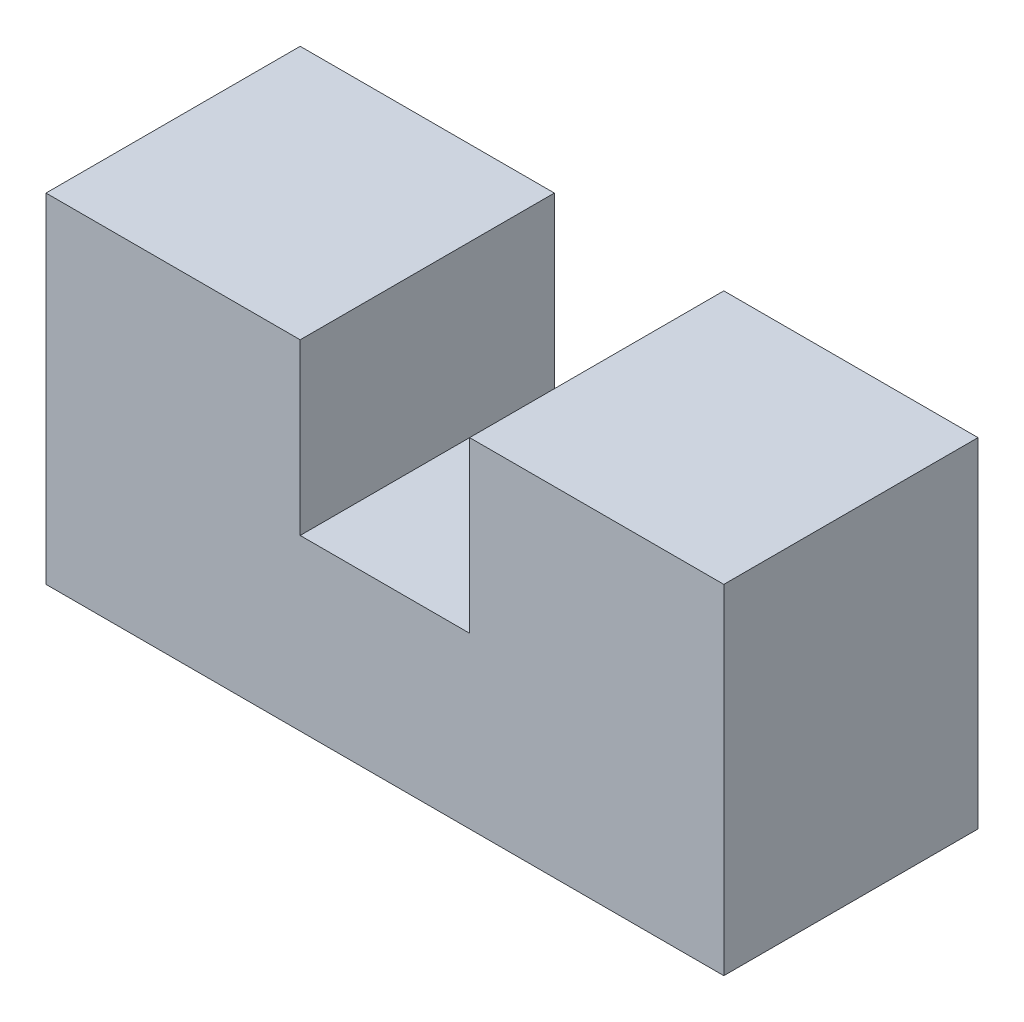
ISO-10303-21;
HEADER;
FILE_DESCRIPTION(('STEP AP214'),'2;1');
FILE_NAME('part.step','',(''),(''),'','','');
FILE_SCHEMA(('AUTOMOTIVE_DESIGN { 1 0 10303 214 1 1 1 1 }'));
ENDSEC;
DATA;
#1=APPLICATION_CONTEXT('core data for automotive mechanical design processes');
#2=APPLICATION_PROTOCOL_DEFINITION('international standard','automotive_design',2000,#1);
#3=PRODUCT_CONTEXT('',#1,'mechanical');
#4=PRODUCT('Part','Part','',(#3));
#5=PRODUCT_RELATED_PRODUCT_CATEGORY('part','',(#4));
#6=PRODUCT_DEFINITION_FORMATION('','',#4);
#7=PRODUCT_DEFINITION_CONTEXT('part definition',#1,'design');
#8=PRODUCT_DEFINITION('design','',#6,#7);
#9=PRODUCT_DEFINITION_SHAPE('','',#8);
#10=(LENGTH_UNIT() NAMED_UNIT(*) SI_UNIT(.MILLI.,.METRE.));
#11=(NAMED_UNIT(*) PLANE_ANGLE_UNIT() SI_UNIT($,.RADIAN.));
#12=(NAMED_UNIT(*) SI_UNIT($,.STERADIAN.) SOLID_ANGLE_UNIT());
#13=UNCERTAINTY_MEASURE_WITH_UNIT(LENGTH_MEASURE(1.E-05),#10,'distance_accuracy_value','');
#14=(GEOMETRIC_REPRESENTATION_CONTEXT(3) GLOBAL_UNCERTAINTY_ASSIGNED_CONTEXT((#13)) GLOBAL_UNIT_ASSIGNED_CONTEXT((#10,
#11,#12)) REPRESENTATION_CONTEXT('',''));
#15=CARTESIAN_POINT('',(0.,0.,0.));
#16=DIRECTION('',(0.,0.,1.));
#17=DIRECTION('',(1.,0.,0.));
#18=AXIS2_PLACEMENT_3D('',#15,#16,#17);
#19=CARTESIAN_POINT('',(30.,0.,15.));
#20=DIRECTION('',(0.,-1.,0.));
#21=DIRECTION('',(1.,0.,0.));
#22=AXIS2_PLACEMENT_3D('',#19,#20,#21);
#23=PLANE('',#22);
#24=DIRECTION('',(-1.,0.,0.));
#25=VECTOR('',#24,1.);
#26=CARTESIAN_POINT('',(30.,0.,-15.));
#27=LINE('',#26,#25);
#28=CARTESIAN_POINT('',(30.,0.,-15.));
#29=VERTEX_POINT('',#28);
#30=CARTESIAN_POINT('',(0.,0.,-15.));
#31=VERTEX_POINT('',#30);
#32=EDGE_CURVE('E140',#29,#31,#27,.T.);
#33=ORIENTED_EDGE('',*,*,#32,.T.);
#34=DIRECTION('',(0.,0.,-1.));
#35=VECTOR('',#34,1.);
#36=CARTESIAN_POINT('',(0.,0.,15.));
#37=LINE('',#36,#35);
#38=CARTESIAN_POINT('',(0.,0.,15.));
#39=VERTEX_POINT('',#38);
#40=EDGE_CURVE('E11',#39,#31,#37,.T.);
#41=ORIENTED_EDGE('',*,*,#40,.F.);
#42=DIRECTION('',(-1.,0.,0.));
#43=VECTOR('',#42,1.);
#44=CARTESIAN_POINT('',(30.,0.,15.));
#45=LINE('',#44,#43);
#46=CARTESIAN_POINT('',(30.,0.,15.));
#47=VERTEX_POINT('',#46);
#48=EDGE_CURVE('E162',#47,#39,#45,.T.);
#49=ORIENTED_EDGE('',*,*,#48,.F.);
#50=DIRECTION('',(0.,0.,-1.));
#51=VECTOR('',#50,1.);
#52=CARTESIAN_POINT('',(30.,0.,15.));
#53=LINE('',#52,#51);
#54=EDGE_CURVE('E136',#47,#29,#53,.T.);
#55=ORIENTED_EDGE('',*,*,#54,.T.);
#56=EDGE_LOOP('',(#33,#41,#49,#55));
#57=FACE_BOUND('',#56,.T.);
#58=ADVANCED_FACE('F39',(#57),#23,.F.);
#59=CARTESIAN_POINT('',(0.,0.,15.));
#60=DIRECTION('',(1.,0.,0.));
#61=DIRECTION('',(0.,0.,-1.));
#62=AXIS2_PLACEMENT_3D('',#59,#60,#61);
#63=PLANE('',#62);
#64=DIRECTION('',(0.,-1.,0.));
#65=VECTOR('',#64,1.);
#66=CARTESIAN_POINT('',(0.,0.,-15.));
#67=LINE('',#66,#65);
#68=CARTESIAN_POINT('',(0.,-40.,-15.));
#69=VERTEX_POINT('',#68);
#70=EDGE_CURVE('E144',#31,#69,#67,.T.);
#71=ORIENTED_EDGE('',*,*,#70,.T.);
#72=DIRECTION('',(0.,0.,-1.));
#73=VECTOR('',#72,1.);
#74=CARTESIAN_POINT('',(0.,-40.,15.));
#75=LINE('',#74,#73);
#76=CARTESIAN_POINT('',(0.,-40.,15.));
#77=VERTEX_POINT('',#76);
#78=EDGE_CURVE('E48',#77,#69,#75,.T.);
#79=ORIENTED_EDGE('',*,*,#78,.F.);
#80=DIRECTION('',(0.,-1.,0.));
#81=VECTOR('',#80,1.);
#82=CARTESIAN_POINT('',(0.,0.,15.));
#83=LINE('',#82,#81);
#84=EDGE_CURVE('E99',#39,#77,#83,.T.);
#85=ORIENTED_EDGE('',*,*,#84,.F.);
#86=ORIENTED_EDGE('',*,*,#40,.T.);
#87=EDGE_LOOP('',(#71,#79,#85,#86));
#88=FACE_BOUND('',#87,.T.);
#89=ADVANCED_FACE('F208',(#88),#63,.F.);
#90=CARTESIAN_POINT('',(0.,-40.,15.));
#91=DIRECTION('',(0.,1.,0.));
#92=DIRECTION('',(0.,0.,1.));
#93=AXIS2_PLACEMENT_3D('',#90,#91,#92);
#94=PLANE('',#93);
#95=DIRECTION('',(1.,0.,0.));
#96=VECTOR('',#95,1.);
#97=CARTESIAN_POINT('',(0.,-40.,-15.));
#98=LINE('',#97,#96);
#99=CARTESIAN_POINT('',(80.,-40.,-15.));
#100=VERTEX_POINT('',#99);
#101=EDGE_CURVE('E147',#69,#100,#98,.T.);
#102=ORIENTED_EDGE('',*,*,#101,.T.);
#103=DIRECTION('',(0.,0.,-1.));
#104=VECTOR('',#103,1.);
#105=CARTESIAN_POINT('',(80.,-40.,15.));
#106=LINE('',#105,#104);
#107=CARTESIAN_POINT('',(80.,-40.,15.));
#108=VERTEX_POINT('',#107);
#109=EDGE_CURVE('E173',#108,#100,#106,.T.);
#110=ORIENTED_EDGE('',*,*,#109,.F.);
#111=DIRECTION('',(1.,0.,0.));
#112=VECTOR('',#111,1.);
#113=CARTESIAN_POINT('',(0.,-40.,15.));
#114=LINE('',#113,#112);
#115=EDGE_CURVE('E183',#77,#108,#114,.T.);
#116=ORIENTED_EDGE('',*,*,#115,.F.);
#117=ORIENTED_EDGE('',*,*,#78,.T.);
#118=EDGE_LOOP('',(#102,#110,#116,#117));
#119=FACE_BOUND('',#118,.T.);
#120=ADVANCED_FACE('F181',(#119),#94,.F.);
#121=CARTESIAN_POINT('',(80.,-40.,15.));
#122=DIRECTION('',(-1.,0.,0.));
#123=DIRECTION('',(0.,0.,1.));
#124=AXIS2_PLACEMENT_3D('',#121,#122,#123);
#125=PLANE('',#124);
#126=DIRECTION('',(0.,1.,0.));
#127=VECTOR('',#126,1.);
#128=CARTESIAN_POINT('',(80.,-40.,-15.));
#129=LINE('',#128,#127);
#130=CARTESIAN_POINT('',(80.,0.,-15.));
#131=VERTEX_POINT('',#130);
#132=EDGE_CURVE('E150',#100,#131,#129,.T.);
#133=ORIENTED_EDGE('',*,*,#132,.T.);
#134=DIRECTION('',(0.,0.,-1.));
#135=VECTOR('',#134,1.);
#136=CARTESIAN_POINT('',(80.,0.,15.));
#137=LINE('',#136,#135);
#138=CARTESIAN_POINT('',(80.,0.,15.));
#139=VERTEX_POINT('',#138);
#140=EDGE_CURVE('E169',#139,#131,#137,.T.);
#141=ORIENTED_EDGE('',*,*,#140,.F.);
#142=DIRECTION('',(0.,1.,0.));
#143=VECTOR('',#142,1.);
#144=CARTESIAN_POINT('',(80.,-40.,15.));
#145=LINE('',#144,#143);
#146=EDGE_CURVE('E196',#108,#139,#145,.T.);
#147=ORIENTED_EDGE('',*,*,#146,.F.);
#148=ORIENTED_EDGE('',*,*,#109,.T.);
#149=EDGE_LOOP('',(#133,#141,#147,#148));
#150=FACE_BOUND('',#149,.T.);
#151=ADVANCED_FACE('F191',(#150),#125,.F.);
#152=CARTESIAN_POINT('',(80.,0.,15.));
#153=DIRECTION('',(0.,-1.,0.));
#154=DIRECTION('',(1.,0.,0.));
#155=AXIS2_PLACEMENT_3D('',#152,#153,#154);
#156=PLANE('',#155);
#157=DIRECTION('',(-1.,0.,0.));
#158=VECTOR('',#157,1.);
#159=CARTESIAN_POINT('',(80.,0.,-15.));
#160=LINE('',#159,#158);
#161=CARTESIAN_POINT('',(50.,0.,-15.));
#162=VERTEX_POINT('',#161);
#163=EDGE_CURVE('E153',#131,#162,#160,.T.);
#164=ORIENTED_EDGE('',*,*,#163,.T.);
#165=DIRECTION('',(0.,0.,-1.));
#166=VECTOR('',#165,1.);
#167=CARTESIAN_POINT('',(50.,0.,15.));
#168=LINE('',#167,#166);
#169=CARTESIAN_POINT('',(50.,0.,15.));
#170=VERTEX_POINT('',#169);
#171=EDGE_CURVE('E129',#170,#162,#168,.T.);
#172=ORIENTED_EDGE('',*,*,#171,.F.);
#173=DIRECTION('',(-1.,0.,0.));
#174=VECTOR('',#173,1.);
#175=CARTESIAN_POINT('',(80.,0.,15.));
#176=LINE('',#175,#174);
#177=EDGE_CURVE('E118',#139,#170,#176,.T.);
#178=ORIENTED_EDGE('',*,*,#177,.F.);
#179=ORIENTED_EDGE('',*,*,#140,.T.);
#180=EDGE_LOOP('',(#164,#172,#178,#179));
#181=FACE_BOUND('',#180,.T.);
#182=ADVANCED_FACE('F194',(#181),#156,.F.);
#183=CARTESIAN_POINT('',(50.,0.,15.));
#184=DIRECTION('',(1.,0.,0.));
#185=DIRECTION('',(0.,0.,-1.));
#186=AXIS2_PLACEMENT_3D('',#183,#184,#185);
#187=PLANE('',#186);
#188=DIRECTION('',(0.,-1.,0.));
#189=VECTOR('',#188,1.);
#190=CARTESIAN_POINT('',(50.,0.,-15.));
#191=LINE('',#190,#189);
#192=CARTESIAN_POINT('',(50.,-20.,-15.));
#193=VERTEX_POINT('',#192);
#194=EDGE_CURVE('E127',#162,#193,#191,.T.);
#195=ORIENTED_EDGE('',*,*,#194,.T.);
#196=DIRECTION('',(0.,0.,-1.));
#197=VECTOR('',#196,1.);
#198=CARTESIAN_POINT('',(50.,-20.,15.));
#199=LINE('',#198,#197);
#200=CARTESIAN_POINT('',(50.,-20.,15.));
#201=VERTEX_POINT('',#200);
#202=EDGE_CURVE('E124',#201,#193,#199,.T.);
#203=ORIENTED_EDGE('',*,*,#202,.F.);
#204=DIRECTION('',(0.,-1.,0.));
#205=VECTOR('',#204,1.);
#206=CARTESIAN_POINT('',(50.,0.,15.));
#207=LINE('',#206,#205);
#208=EDGE_CURVE('E112',#170,#201,#207,.T.);
#209=ORIENTED_EDGE('',*,*,#208,.F.);
#210=ORIENTED_EDGE('',*,*,#171,.T.);
#211=EDGE_LOOP('',(#195,#203,#209,#210));
#212=FACE_BOUND('',#211,.T.);
#213=ADVANCED_FACE('F125',(#212),#187,.F.);
#214=CARTESIAN_POINT('',(50.,-20.,15.));
#215=DIRECTION('',(0.,-1.,0.));
#216=DIRECTION('',(1.,0.,0.));
#217=AXIS2_PLACEMENT_3D('',#214,#215,#216);
#218=PLANE('',#217);
#219=DIRECTION('',(-1.,0.,0.));
#220=VECTOR('',#219,1.);
#221=CARTESIAN_POINT('',(50.,-20.,-15.));
#222=LINE('',#221,#220);
#223=CARTESIAN_POINT('',(30.,-20.,-15.));
#224=VERTEX_POINT('',#223);
#225=EDGE_CURVE('E85',#193,#224,#222,.T.);
#226=ORIENTED_EDGE('',*,*,#225,.T.);
#227=DIRECTION('',(0.,0.,-1.));
#228=VECTOR('',#227,1.);
#229=CARTESIAN_POINT('',(30.,-20.,15.));
#230=LINE('',#229,#228);
#231=CARTESIAN_POINT('',(30.,-20.,15.));
#232=VERTEX_POINT('',#231);
#233=EDGE_CURVE('E130',#232,#224,#230,.T.);
#234=ORIENTED_EDGE('',*,*,#233,.F.);
#235=DIRECTION('',(-1.,0.,0.));
#236=VECTOR('',#235,1.);
#237=CARTESIAN_POINT('',(50.,-20.,15.));
#238=LINE('',#237,#236);
#239=EDGE_CURVE('E116',#201,#232,#238,.T.);
#240=ORIENTED_EDGE('',*,*,#239,.F.);
#241=ORIENTED_EDGE('',*,*,#202,.T.);
#242=EDGE_LOOP('',(#226,#234,#240,#241));
#243=FACE_BOUND('',#242,.T.);
#244=ADVANCED_FACE('F132',(#243),#218,.F.);
#245=CARTESIAN_POINT('',(30.,-20.,15.));
#246=DIRECTION('',(-1.,0.,0.));
#247=DIRECTION('',(0.,-1.,0.));
#248=AXIS2_PLACEMENT_3D('',#245,#246,#247);
#249=PLANE('',#248);
#250=DIRECTION('',(0.,1.,0.));
#251=VECTOR('',#250,1.);
#252=CARTESIAN_POINT('',(30.,-20.,-15.));
#253=LINE('',#252,#251);
#254=EDGE_CURVE('E91',#224,#29,#253,.T.);
#255=ORIENTED_EDGE('',*,*,#254,.T.);
#256=ORIENTED_EDGE('',*,*,#54,.F.);
#257=DIRECTION('',(0.,1.,0.));
#258=VECTOR('',#257,1.);
#259=CARTESIAN_POINT('',(30.,-20.,15.));
#260=LINE('',#259,#258);
#261=EDGE_CURVE('E56',#232,#47,#260,.T.);
#262=ORIENTED_EDGE('',*,*,#261,.F.);
#263=ORIENTED_EDGE('',*,*,#233,.T.);
#264=EDGE_LOOP('',(#255,#256,#262,#263));
#265=FACE_BOUND('',#264,.T.);
#266=ADVANCED_FACE('F224',(#265),#249,.F.);
#267=CARTESIAN_POINT('',(0.,0.,15.));
#268=DIRECTION('',(0.,0.,1.));
#269=DIRECTION('',(1.,0.,0.));
#270=AXIS2_PLACEMENT_3D('',#267,#268,#269);
#271=PLANE('',#270);
#272=ORIENTED_EDGE('',*,*,#48,.T.);
#273=ORIENTED_EDGE('',*,*,#84,.T.);
#274=ORIENTED_EDGE('',*,*,#115,.T.);
#275=ORIENTED_EDGE('',*,*,#146,.T.);
#276=ORIENTED_EDGE('',*,*,#177,.T.);
#277=ORIENTED_EDGE('',*,*,#208,.T.);
#278=ORIENTED_EDGE('',*,*,#239,.T.);
#279=ORIENTED_EDGE('',*,*,#261,.T.);
#280=EDGE_LOOP('',(#272,#273,#274,#275,#276,#277,#278,#279));
#281=FACE_BOUND('',#280,.T.);
#282=ADVANCED_FACE('F114',(#281),#271,.T.);
#283=CARTESIAN_POINT('',(0.,0.,-15.));
#284=DIRECTION('',(0.,0.,1.));
#285=DIRECTION('',(1.,0.,0.));
#286=AXIS2_PLACEMENT_3D('',#283,#284,#285);
#287=PLANE('',#286);
#288=ORIENTED_EDGE('',*,*,#32,.F.);
#289=ORIENTED_EDGE('',*,*,#254,.F.);
#290=ORIENTED_EDGE('',*,*,#225,.F.);
#291=ORIENTED_EDGE('',*,*,#194,.F.);
#292=ORIENTED_EDGE('',*,*,#163,.F.);
#293=ORIENTED_EDGE('',*,*,#132,.F.);
#294=ORIENTED_EDGE('',*,*,#101,.F.);
#295=ORIENTED_EDGE('',*,*,#70,.F.);
#296=EDGE_LOOP('',(#288,#289,#290,#291,#292,#293,#294,#295));
#297=FACE_BOUND('',#296,.T.);
#298=ADVANCED_FACE('F187',(#297),#287,.F.);
#299=CLOSED_SHELL('',(#58,#89,#120,#151,#182,#213,#244,#266,#282,#298));
#300=MANIFOLD_SOLID_BREP('B2',#299);
#301=ADVANCED_BREP_SHAPE_REPRESENTATION('',(#18,#300),#14);
#302=SHAPE_DEFINITION_REPRESENTATION(#9,#301);
ENDSEC;
END-ISO-10303-21;
